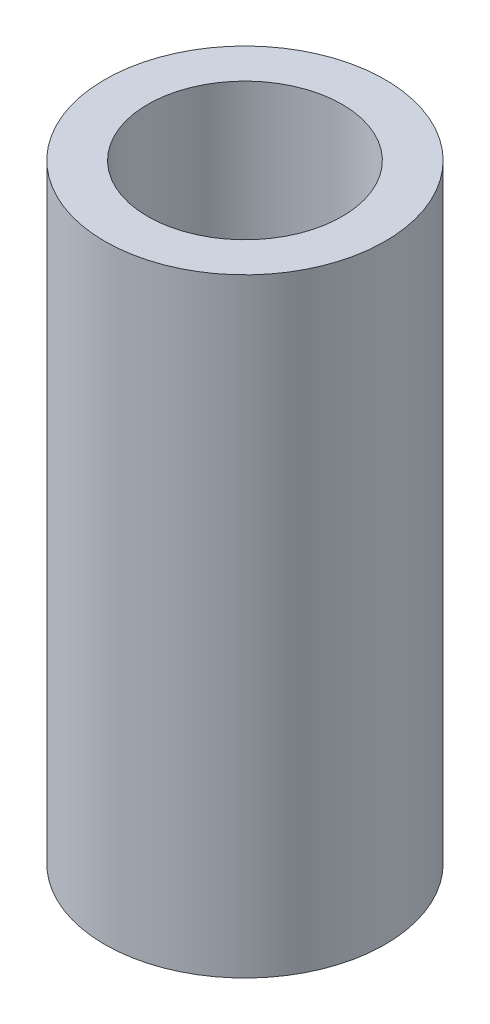
ISO-10303-21;
HEADER;
FILE_DESCRIPTION(('STEP AP214'),'2;1');
FILE_NAME('part.step','',(''),(''),'','','');
FILE_SCHEMA(('AUTOMOTIVE_DESIGN { 1 0 10303 214 1 1 1 1 }'));
ENDSEC;
DATA;
#1=APPLICATION_CONTEXT('core data for automotive mechanical design processes');
#2=APPLICATION_PROTOCOL_DEFINITION('international standard','automotive_design',2000,#1);
#3=PRODUCT_CONTEXT('',#1,'mechanical');
#4=PRODUCT('Part','Part','',(#3));
#5=PRODUCT_RELATED_PRODUCT_CATEGORY('part','',(#4));
#6=PRODUCT_DEFINITION_FORMATION('','',#4);
#7=PRODUCT_DEFINITION_CONTEXT('part definition',#1,'design');
#8=PRODUCT_DEFINITION('design','',#6,#7);
#9=PRODUCT_DEFINITION_SHAPE('','',#8);
#10=(LENGTH_UNIT() NAMED_UNIT(*) SI_UNIT(.MILLI.,.METRE.));
#11=(NAMED_UNIT(*) PLANE_ANGLE_UNIT() SI_UNIT($,.RADIAN.));
#12=(NAMED_UNIT(*) SI_UNIT($,.STERADIAN.) SOLID_ANGLE_UNIT());
#13=UNCERTAINTY_MEASURE_WITH_UNIT(LENGTH_MEASURE(1.E-05),#10,'distance_accuracy_value','');
#14=(GEOMETRIC_REPRESENTATION_CONTEXT(3) GLOBAL_UNCERTAINTY_ASSIGNED_CONTEXT((#13)) GLOBAL_UNIT_ASSIGNED_CONTEXT((#10,
#11,#12)) REPRESENTATION_CONTEXT('',''));
#15=CARTESIAN_POINT('',(0.,0.,0.));
#16=DIRECTION('',(0.,0.,1.));
#17=DIRECTION('',(1.,0.,0.));
#18=AXIS2_PLACEMENT_3D('',#15,#16,#17);
#19=CARTESIAN_POINT('',(0.,76.0451538666575,0.));
#20=DIRECTION('',(0.,-1.,0.));
#21=DIRECTION('',(0.,0.,-1.));
#22=AXIS2_PLACEMENT_3D('',#19,#20,#21);
#23=CYLINDRICAL_SURFACE('',#22,17.5);
#24=CARTESIAN_POINT('',(0.,76.0451538666575,0.));
#25=DIRECTION('',(0.,1.,0.));
#26=DIRECTION('',(0.,0.,1.));
#27=AXIS2_PLACEMENT_3D('',#24,#25,#26);
#28=CIRCLE('',#27,17.5);
#29=CARTESIAN_POINT('',(0.,76.0451538666575,17.5));
#30=VERTEX_POINT('',#29);
#31=EDGE_CURVE('E10',#30,#30,#28,.T.);
#32=ORIENTED_EDGE('',*,*,#31,.F.);
#33=EDGE_LOOP('',(#32));
#34=FACE_BOUND('',#33,.T.);
#35=CARTESIAN_POINT('',(0.,0.,0.));
#36=DIRECTION('',(0.,1.,0.));
#37=DIRECTION('',(0.,0.,1.));
#38=AXIS2_PLACEMENT_3D('',#35,#36,#37);
#39=CIRCLE('',#38,17.5);
#40=CARTESIAN_POINT('',(0.,0.,17.5));
#41=VERTEX_POINT('',#40);
#42=EDGE_CURVE('E37',#41,#41,#39,.T.);
#43=ORIENTED_EDGE('',*,*,#42,.T.);
#44=EDGE_LOOP('',(#43));
#45=FACE_BOUND('',#44,.T.);
#46=ADVANCED_FACE('F40',(#34,#45),#23,.T.);
#47=CARTESIAN_POINT('',(0.,76.0451538666575,0.));
#48=DIRECTION('',(0.,1.,0.));
#49=DIRECTION('',(0.,0.,1.));
#50=AXIS2_PLACEMENT_3D('',#47,#48,#49);
#51=PLANE('',#50);
#52=CARTESIAN_POINT('',(0.,76.0451538666575,0.));
#53=DIRECTION('',(0.,1.,0.));
#54=DIRECTION('',(0.,0.,1.));
#55=AXIS2_PLACEMENT_3D('',#52,#53,#54);
#56=CIRCLE('',#55,12.1366018406353);
#57=CARTESIAN_POINT('',(0.,76.0451538666575,12.1366018406353));
#58=VERTEX_POINT('',#57);
#59=EDGE_CURVE('E50',#58,#58,#56,.T.);
#60=ORIENTED_EDGE('',*,*,#59,.F.);
#61=EDGE_LOOP('',(#60));
#62=FACE_BOUND('',#61,.T.);
#63=ORIENTED_EDGE('',*,*,#31,.T.);
#64=EDGE_LOOP('',(#63));
#65=FACE_BOUND('',#64,.T.);
#66=ADVANCED_FACE('F59',(#62,#65),#51,.T.);
#67=CARTESIAN_POINT('',(0.,0.,0.));
#68=DIRECTION('',(0.,1.,0.));
#69=DIRECTION('',(0.,0.,1.));
#70=AXIS2_PLACEMENT_3D('',#67,#68,#69);
#71=PLANE('',#70);
#72=CARTESIAN_POINT('',(0.,0.,0.));
#73=DIRECTION('',(0.,1.,0.));
#74=DIRECTION('',(0.,0.,1.));
#75=AXIS2_PLACEMENT_3D('',#72,#73,#74);
#76=CIRCLE('',#75,12.1366018406353);
#77=CARTESIAN_POINT('',(0.,0.,12.1366018406353));
#78=VERTEX_POINT('',#77);
#79=EDGE_CURVE('E47',#78,#78,#76,.T.);
#80=ORIENTED_EDGE('',*,*,#79,.T.);
#81=EDGE_LOOP('',(#80));
#82=FACE_BOUND('',#81,.T.);
#83=ORIENTED_EDGE('',*,*,#42,.F.);
#84=EDGE_LOOP('',(#83));
#85=FACE_BOUND('',#84,.T.);
#86=ADVANCED_FACE('F58',(#82,#85),#71,.F.);
#87=CARTESIAN_POINT('',(0.,76.0451538666575,0.));
#88=DIRECTION('',(0.,-1.,0.));
#89=DIRECTION('',(0.,0.,-1.));
#90=AXIS2_PLACEMENT_3D('',#87,#88,#89);
#91=CYLINDRICAL_SURFACE('',#90,12.1366018406353);
#92=ORIENTED_EDGE('',*,*,#59,.T.);
#93=EDGE_LOOP('',(#92));
#94=FACE_BOUND('',#93,.T.);
#95=ORIENTED_EDGE('',*,*,#79,.F.);
#96=EDGE_LOOP('',(#95));
#97=FACE_BOUND('',#96,.T.);
#98=ADVANCED_FACE('F54',(#94,#97),#91,.F.);
#99=CLOSED_SHELL('',(#46,#66,#86,#98));
#100=MANIFOLD_SOLID_BREP('B2',#99);
#101=ADVANCED_BREP_SHAPE_REPRESENTATION('',(#18,#100),#14);
#102=SHAPE_DEFINITION_REPRESENTATION(#9,#101);
ENDSEC;
END-ISO-10303-21;
